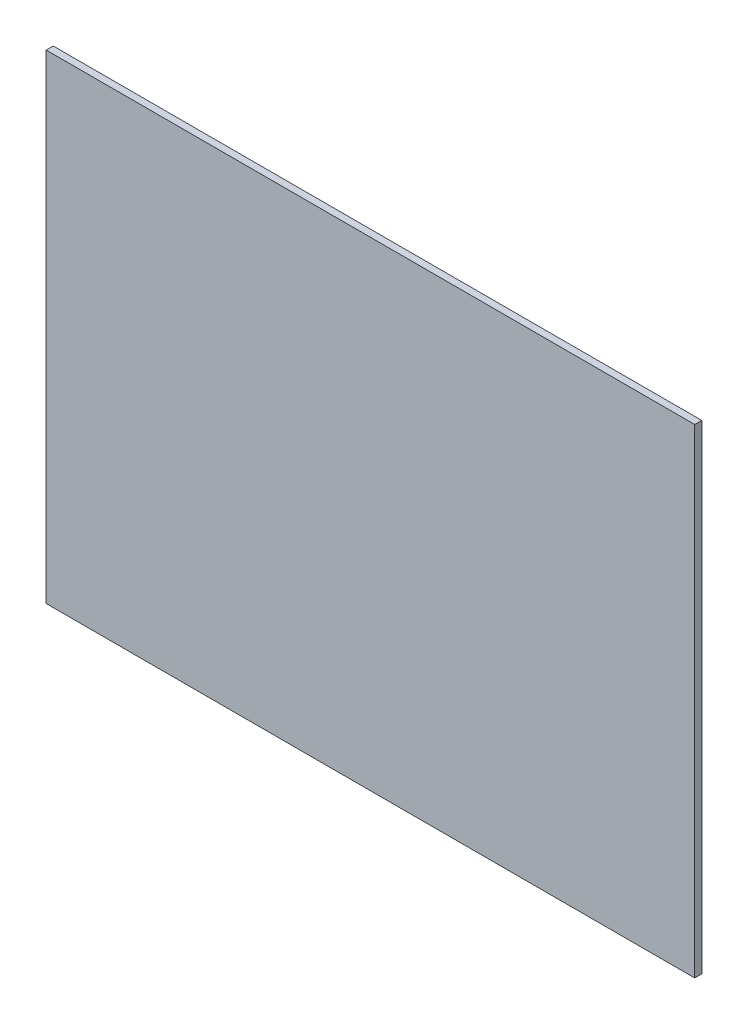
ISO-10303-21;
HEADER;
FILE_DESCRIPTION(('STEP AP214'),'2;1');
FILE_NAME('part.step','',(''),(''),'','','');
FILE_SCHEMA(('AUTOMOTIVE_DESIGN { 1 0 10303 214 1 1 1 1 }'));
ENDSEC;
DATA;
#1=APPLICATION_CONTEXT('core data for automotive mechanical design processes');
#2=APPLICATION_PROTOCOL_DEFINITION('international standard','automotive_design',2000,#1);
#3=PRODUCT_CONTEXT('',#1,'mechanical');
#4=PRODUCT('Part','Part','',(#3));
#5=PRODUCT_RELATED_PRODUCT_CATEGORY('part','',(#4));
#6=PRODUCT_DEFINITION_FORMATION('','',#4);
#7=PRODUCT_DEFINITION_CONTEXT('part definition',#1,'design');
#8=PRODUCT_DEFINITION('design','',#6,#7);
#9=PRODUCT_DEFINITION_SHAPE('','',#8);
#10=(LENGTH_UNIT() NAMED_UNIT(*) SI_UNIT(.MILLI.,.METRE.));
#11=(NAMED_UNIT(*) PLANE_ANGLE_UNIT() SI_UNIT($,.RADIAN.));
#12=(NAMED_UNIT(*) SI_UNIT($,.STERADIAN.) SOLID_ANGLE_UNIT());
#13=UNCERTAINTY_MEASURE_WITH_UNIT(LENGTH_MEASURE(1.E-05),#10,'distance_accuracy_value','');
#14=(GEOMETRIC_REPRESENTATION_CONTEXT(3) GLOBAL_UNCERTAINTY_ASSIGNED_CONTEXT((#13)) GLOBAL_UNIT_ASSIGNED_CONTEXT((#10,
#11,#12)) REPRESENTATION_CONTEXT('',''));
#15=CARTESIAN_POINT('',(0.,0.,0.));
#16=DIRECTION('',(0.,0.,1.));
#17=DIRECTION('',(1.,0.,0.));
#18=AXIS2_PLACEMENT_3D('',#15,#16,#17);
#19=CARTESIAN_POINT('',(292.1,215.9,6.35));
#20=DIRECTION('',(-1.,0.,0.));
#21=DIRECTION('',(0.,0.,1.));
#22=AXIS2_PLACEMENT_3D('',#19,#20,#21);
#23=PLANE('',#22);
#24=DIRECTION('',(0.,1.,0.));
#25=VECTOR('',#24,1.);
#26=CARTESIAN_POINT('',(292.1,215.9,0.));
#27=LINE('',#26,#25);
#28=CARTESIAN_POINT('',(292.1,-215.9,0.));
#29=VERTEX_POINT('',#28);
#30=CARTESIAN_POINT('',(292.1,215.9,0.));
#31=VERTEX_POINT('',#30);
#32=EDGE_CURVE('E107',#29,#31,#27,.T.);
#33=ORIENTED_EDGE('',*,*,#32,.T.);
#34=DIRECTION('',(0.,0.,-1.));
#35=VECTOR('',#34,1.);
#36=CARTESIAN_POINT('',(292.1,215.9,6.35));
#37=LINE('',#36,#35);
#38=CARTESIAN_POINT('',(292.1,215.9,6.35));
#39=VERTEX_POINT('',#38);
#40=EDGE_CURVE('E11',#39,#31,#37,.T.);
#41=ORIENTED_EDGE('',*,*,#40,.F.);
#42=DIRECTION('',(0.,1.,0.));
#43=VECTOR('',#42,1.);
#44=CARTESIAN_POINT('',(292.1,215.9,6.35));
#45=LINE('',#44,#43);
#46=CARTESIAN_POINT('',(292.1,-215.9,6.35));
#47=VERTEX_POINT('',#46);
#48=EDGE_CURVE('E91',#47,#39,#45,.T.);
#49=ORIENTED_EDGE('',*,*,#48,.F.);
#50=DIRECTION('',(0.,0.,-1.));
#51=VECTOR('',#50,1.);
#52=CARTESIAN_POINT('',(292.1,-215.9,6.35));
#53=LINE('',#52,#51);
#54=EDGE_CURVE('E103',#47,#29,#53,.T.);
#55=ORIENTED_EDGE('',*,*,#54,.T.);
#56=EDGE_LOOP('',(#33,#41,#49,#55));
#57=FACE_BOUND('',#56,.T.);
#58=ADVANCED_FACE('F39',(#57),#23,.F.);
#59=CARTESIAN_POINT('',(-292.1,215.9,6.35));
#60=DIRECTION('',(0.,-1.,0.));
#61=DIRECTION('',(0.,0.,-1.));
#62=AXIS2_PLACEMENT_3D('',#59,#60,#61);
#63=PLANE('',#62);
#64=DIRECTION('',(-1.,0.,0.));
#65=VECTOR('',#64,1.);
#66=CARTESIAN_POINT('',(-292.1,215.9,0.));
#67=LINE('',#66,#65);
#68=CARTESIAN_POINT('',(-292.1,215.9,0.));
#69=VERTEX_POINT('',#68);
#70=EDGE_CURVE('E96',#31,#69,#67,.T.);
#71=ORIENTED_EDGE('',*,*,#70,.T.);
#72=DIRECTION('',(0.,0.,-1.));
#73=VECTOR('',#72,1.);
#74=CARTESIAN_POINT('',(-292.1,215.9,6.35));
#75=LINE('',#74,#73);
#76=CARTESIAN_POINT('',(-292.1,215.9,6.35));
#77=VERTEX_POINT('',#76);
#78=EDGE_CURVE('E48',#77,#69,#75,.T.);
#79=ORIENTED_EDGE('',*,*,#78,.F.);
#80=DIRECTION('',(-1.,0.,0.));
#81=VECTOR('',#80,1.);
#82=CARTESIAN_POINT('',(-292.1,215.9,6.35));
#83=LINE('',#82,#81);
#84=EDGE_CURVE('E86',#39,#77,#83,.T.);
#85=ORIENTED_EDGE('',*,*,#84,.F.);
#86=ORIENTED_EDGE('',*,*,#40,.T.);
#87=EDGE_LOOP('',(#71,#79,#85,#86));
#88=FACE_BOUND('',#87,.T.);
#89=ADVANCED_FACE('F95',(#88),#63,.F.);
#90=CARTESIAN_POINT('',(-292.1,215.9,6.35));
#91=DIRECTION('',(1.,0.,0.));
#92=DIRECTION('',(0.,1.,0.));
#93=AXIS2_PLACEMENT_3D('',#90,#91,#92);
#94=PLANE('',#93);
#95=DIRECTION('',(0.,-1.,0.));
#96=VECTOR('',#95,1.);
#97=CARTESIAN_POINT('',(-292.1,215.9,0.));
#98=LINE('',#97,#96);
#99=CARTESIAN_POINT('',(-292.1,-215.9,0.));
#100=VERTEX_POINT('',#99);
#101=EDGE_CURVE('E73',#69,#100,#98,.T.);
#102=ORIENTED_EDGE('',*,*,#101,.T.);
#103=DIRECTION('',(0.,0.,-1.));
#104=VECTOR('',#103,1.);
#105=CARTESIAN_POINT('',(-292.1,-215.9,6.35));
#106=LINE('',#105,#104);
#107=CARTESIAN_POINT('',(-292.1,-215.9,6.35));
#108=VERTEX_POINT('',#107);
#109=EDGE_CURVE('E98',#108,#100,#106,.T.);
#110=ORIENTED_EDGE('',*,*,#109,.F.);
#111=DIRECTION('',(0.,-1.,0.));
#112=VECTOR('',#111,1.);
#113=CARTESIAN_POINT('',(-292.1,215.9,6.35));
#114=LINE('',#113,#112);
#115=EDGE_CURVE('E89',#77,#108,#114,.T.);
#116=ORIENTED_EDGE('',*,*,#115,.F.);
#117=ORIENTED_EDGE('',*,*,#78,.T.);
#118=EDGE_LOOP('',(#102,#110,#116,#117));
#119=FACE_BOUND('',#118,.T.);
#120=ADVANCED_FACE('F99',(#119),#94,.F.);
#121=CARTESIAN_POINT('',(-292.1,-215.9,6.35));
#122=DIRECTION('',(0.,1.,0.));
#123=DIRECTION('',(0.,0.,1.));
#124=AXIS2_PLACEMENT_3D('',#121,#122,#123);
#125=PLANE('',#124);
#126=DIRECTION('',(1.,0.,0.));
#127=VECTOR('',#126,1.);
#128=CARTESIAN_POINT('',(-292.1,-215.9,0.));
#129=LINE('',#128,#127);
#130=EDGE_CURVE('E79',#100,#29,#129,.T.);
#131=ORIENTED_EDGE('',*,*,#130,.T.);
#132=ORIENTED_EDGE('',*,*,#54,.F.);
#133=DIRECTION('',(1.,0.,0.));
#134=VECTOR('',#133,1.);
#135=CARTESIAN_POINT('',(-292.1,-215.9,6.35));
#136=LINE('',#135,#134);
#137=EDGE_CURVE('E56',#108,#47,#136,.T.);
#138=ORIENTED_EDGE('',*,*,#137,.F.);
#139=ORIENTED_EDGE('',*,*,#109,.T.);
#140=EDGE_LOOP('',(#131,#132,#138,#139));
#141=FACE_BOUND('',#140,.T.);
#142=ADVANCED_FACE('F120',(#141),#125,.F.);
#143=CARTESIAN_POINT('',(0.,0.,6.35));
#144=DIRECTION('',(0.,0.,1.));
#145=DIRECTION('',(1.,0.,0.));
#146=AXIS2_PLACEMENT_3D('',#143,#144,#145);
#147=PLANE('',#146);
#148=ORIENTED_EDGE('',*,*,#48,.T.);
#149=ORIENTED_EDGE('',*,*,#84,.T.);
#150=ORIENTED_EDGE('',*,*,#115,.T.);
#151=ORIENTED_EDGE('',*,*,#137,.T.);
#152=EDGE_LOOP('',(#148,#149,#150,#151));
#153=FACE_BOUND('',#152,.T.);
#154=ADVANCED_FACE('F87',(#153),#147,.T.);
#155=CARTESIAN_POINT('',(0.,0.,0.));
#156=DIRECTION('',(0.,0.,1.));
#157=DIRECTION('',(1.,0.,0.));
#158=AXIS2_PLACEMENT_3D('',#155,#156,#157);
#159=PLANE('',#158);
#160=ORIENTED_EDGE('',*,*,#32,.F.);
#161=ORIENTED_EDGE('',*,*,#130,.F.);
#162=ORIENTED_EDGE('',*,*,#101,.F.);
#163=ORIENTED_EDGE('',*,*,#70,.F.);
#164=EDGE_LOOP('',(#160,#161,#162,#163));
#165=FACE_BOUND('',#164,.T.);
#166=ADVANCED_FACE('F123',(#165),#159,.F.);
#167=CLOSED_SHELL('',(#58,#89,#120,#142,#154,#166));
#168=MANIFOLD_SOLID_BREP('B2',#167);
#169=ADVANCED_BREP_SHAPE_REPRESENTATION('',(#18,#168),#14);
#170=SHAPE_DEFINITION_REPRESENTATION(#9,#169);
ENDSEC;
END-ISO-10303-21;
